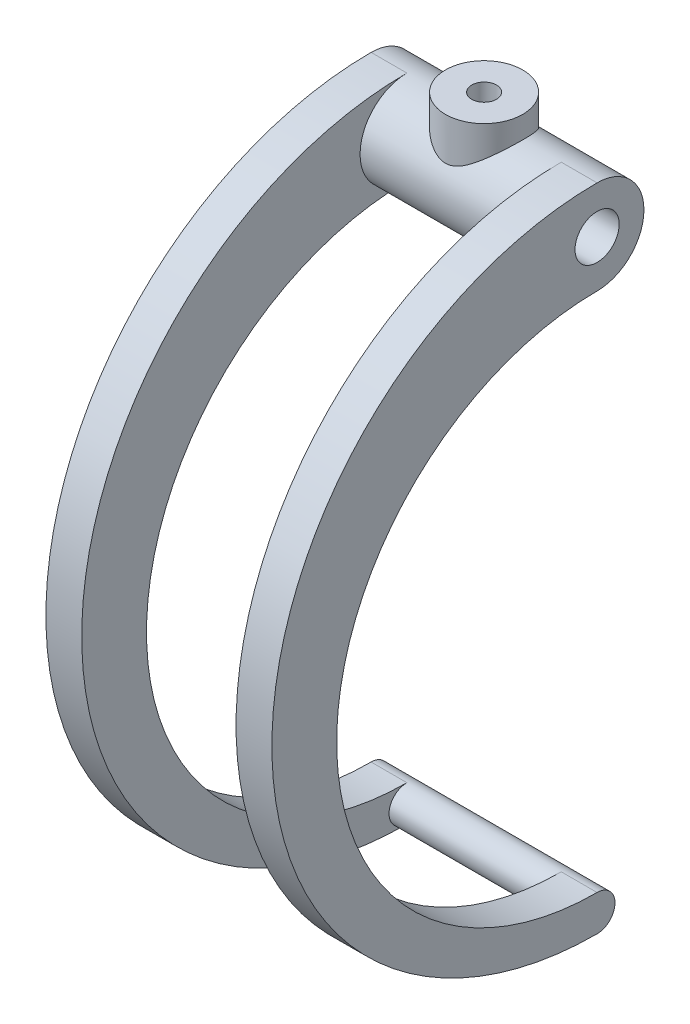
ISO-10303-21;
HEADER;
FILE_DESCRIPTION(('STEP AP214'),'2;1');
FILE_NAME('part.step','',(''),(''),'','','');
FILE_SCHEMA(('AUTOMOTIVE_DESIGN { 1 0 10303 214 1 1 1 1 }'));
ENDSEC;
DATA;
#1=APPLICATION_CONTEXT('core data for automotive mechanical design processes');
#2=APPLICATION_PROTOCOL_DEFINITION('international standard','automotive_design',2000,#1);
#3=PRODUCT_CONTEXT('',#1,'mechanical');
#4=PRODUCT('Part','Part','',(#3));
#5=PRODUCT_RELATED_PRODUCT_CATEGORY('part','',(#4));
#6=PRODUCT_DEFINITION_FORMATION('','',#4);
#7=PRODUCT_DEFINITION_CONTEXT('part definition',#1,'design');
#8=PRODUCT_DEFINITION('design','',#6,#7);
#9=PRODUCT_DEFINITION_SHAPE('','',#8);
#10=(LENGTH_UNIT() NAMED_UNIT(*) SI_UNIT(.MILLI.,.METRE.));
#11=(NAMED_UNIT(*) PLANE_ANGLE_UNIT() SI_UNIT($,.RADIAN.));
#12=(NAMED_UNIT(*) SI_UNIT($,.STERADIAN.) SOLID_ANGLE_UNIT());
#13=UNCERTAINTY_MEASURE_WITH_UNIT(LENGTH_MEASURE(1.E-05),#10,'distance_accuracy_value','');
#14=(GEOMETRIC_REPRESENTATION_CONTEXT(3) GLOBAL_UNCERTAINTY_ASSIGNED_CONTEXT((#13)) GLOBAL_UNIT_ASSIGNED_CONTEXT((#10,
#11,#12)) REPRESENTATION_CONTEXT('',''));
#15=CARTESIAN_POINT('',(0.,0.,0.));
#16=DIRECTION('',(0.,0.,1.));
#17=DIRECTION('',(1.,0.,0.));
#18=AXIS2_PLACEMENT_3D('',#15,#16,#17);
#19=CARTESIAN_POINT('',(32.54375,0.,0.));
#20=DIRECTION('',(-1.,0.,0.));
#21=DIRECTION('',(0.,0.,1.));
#22=AXIS2_PLACEMENT_3D('',#19,#20,#21);
#23=CYLINDRICAL_SURFACE('',#22,13.49375);
#24=CARTESIAN_POINT('',(0.,7.65464779153816,11.1125));
#25=CARTESIAN_POINT('',(0.200158173206272,7.65465325673617,11.1124978738501));
#26=CARTESIAN_POINT('',(0.400370789545028,7.66253889966513,11.1070771424515));
#27=CARTESIAN_POINT('',(0.79909256191196,7.69367298682588,11.0855322743124));
#28=CARTESIAN_POINT('',(0.9976005739117,7.71693103882504,11.069401443723));
#29=CARTESIAN_POINT('',(1.39179858537695,7.7777054292928,11.0267836778847));
#30=CARTESIAN_POINT('',(1.5874799957493,7.81525838928755,11.0002701385525));
#31=CARTESIAN_POINT('',(1.97442544136402,7.90293812276999,10.9374474884532));
#32=CARTESIAN_POINT('',(2.16568777700731,7.95306964893638,10.9011346747409));
#33=CARTESIAN_POINT('',(2.61394799986666,8.08484960801215,10.8039560072756));
#34=CARTESIAN_POINT('',(2.86865758574929,8.1712637695906,10.7389907411659));
#35=CARTESIAN_POINT('',(3.36760620110872,8.35948083501022,10.5931361818023));
#36=CARTESIAN_POINT('',(3.61183999413755,8.46129132242062,10.5122390352189));
#37=CARTESIAN_POINT('',(4.09038140849582,8.67634986535758,10.3354565417209));
#38=CARTESIAN_POINT('',(4.3246621045667,8.7896264494729,10.2395334678048));
#39=CARTESIAN_POINT('',(4.78289007420915,9.02390879623144,10.0336783723073));
#40=CARTESIAN_POINT('',(5.00683774973716,9.14491425778253,9.92374689628233));
#41=CARTESIAN_POINT('',(5.53642040437713,9.44349627972305,9.64155785401084));
#42=CARTESIAN_POINT('',(5.83703167688502,9.62356011113677,9.462466856834));
#43=CARTESIAN_POINT('',(6.41878371350189,9.98713957613382,9.07791108190461));
#44=CARTESIAN_POINT('',(6.69991648077871,10.1706565885516,8.87243556970538));
#45=CARTESIAN_POINT('',(7.24216246776736,10.535769866805,8.43562786117424));
#46=CARTESIAN_POINT('',(7.50329336309778,10.717367703346,8.20431894874998));
#47=CARTESIAN_POINT('',(8.00474927907056,11.0742342987079,7.71583301208199));
#48=CARTESIAN_POINT('',(8.24508187545876,11.2495053483755,7.45866548121699));
#49=CARTESIAN_POINT('',(8.65562885106799,11.5541678479156,6.97469940810094));
#50=CARTESIAN_POINT('',(8.8300386155095,11.6855270677951,6.75268825735483));
#51=CARTESIAN_POINT('',(9.163508845195,11.9395079897718,6.29272759611728));
#52=CARTESIAN_POINT('',(9.32257239456576,12.0621314461931,6.0547813044618));
#53=CARTESIAN_POINT('',(9.62372688643811,12.2963740019145,5.56366819136347));
#54=CARTESIAN_POINT('',(9.76583825905625,12.4080063183828,5.3105202552907));
#55=CARTESIAN_POINT('',(10.0316183528942,12.6182562781753,4.78954591847634));
#56=CARTESIAN_POINT('',(10.1552903339218,12.7168762215364,4.52172212368221));
#57=CARTESIAN_POINT('',(10.3631309906824,12.8835145874023,4.0192111389305));
#58=CARTESIAN_POINT('',(10.4504423942751,12.9538866441518,3.7866008775075));
#59=CARTESIAN_POINT('',(10.6100431506194,13.0829830340143,3.31315782429149));
#60=CARTESIAN_POINT('',(10.6823354892834,13.1417096822235,3.07232667798354));
#61=CARTESIAN_POINT('',(10.8108957394715,13.2464224967769,2.58378827749192));
#62=CARTESIAN_POINT('',(10.8671691266982,13.2924130165211,2.33608340478235));
#63=CARTESIAN_POINT('',(10.9628610066524,13.3707590917075,1.83529638815646));
#64=CARTESIAN_POINT('',(11.0022793032608,13.4031144884966,1.58221418170758));
#65=CARTESIAN_POINT('',(11.063723948938,13.4535984668296,1.071486346123));
#66=CARTESIAN_POINT('',(11.085679688776,13.471669287409,0.813826453860515));
#67=CARTESIAN_POINT('',(11.1115436191247,13.4929603935418,0.296985149964065));
#68=CARTESIAN_POINT('',(11.1154517726617,13.4961806486714,0.0378037352140966));
#69=CARTESIAN_POINT('',(11.1051498227096,13.4876972511228,-0.47994595331303));
#70=CARTESIAN_POINT('',(11.0909400384261,13.4759938613726,-0.738514237812036));
#71=CARTESIAN_POINT('',(11.0446583201216,13.4379290399988,-1.25294510378007));
#72=CARTESIAN_POINT('',(11.0125869365436,13.4115680600799,-1.50880776838089));
#73=CARTESIAN_POINT('',(10.9337348775411,13.3468991946308,-1.99973158186682));
#74=CARTESIAN_POINT('',(10.888020131279,13.3094583238863,-2.23508032083289));
#75=CARTESIAN_POINT('',(10.7820505170953,13.2229085730859,-2.70036931443103));
#76=CARTESIAN_POINT('',(10.7217906783647,13.173795704194,-2.93030769051575));
#77=CARTESIAN_POINT('',(10.587531997121,13.0647592128906,-3.38343859162769));
#78=CARTESIAN_POINT('',(10.5135359685794,13.0048378047681,-3.60663248744738));
#79=CARTESIAN_POINT('',(10.3526227117929,12.875098619512,-4.04542912622839));
#80=CARTESIAN_POINT('',(10.2657007353716,12.8052772061824,-4.26102904349342));
#81=CARTESIAN_POINT('',(10.071577873518,12.650162437239,-4.70257200349256));
#82=CARTESIAN_POINT('',(9.96326191871938,12.5640459232316,-4.92773502784488));
#83=CARTESIAN_POINT('',(9.73343390687931,12.3825842639337,-5.36744824273405));
#84=CARTESIAN_POINT('',(9.61191643842626,12.2872353359532,-5.58199402832746));
#85=CARTESIAN_POINT('',(9.35674067359687,12.0886643166985,-5.99991740187234));
#86=CARTESIAN_POINT('',(9.22308200612685,11.9854419847903,-6.20329464815425));
#87=CARTESIAN_POINT('',(8.944526456888,11.7724309948213,-6.59860473194218));
#88=CARTESIAN_POINT('',(8.79962800930607,11.6626414223679,-6.79053596829386));
#89=CARTESIAN_POINT('',(8.46822155735278,11.414462518478,-7.20140673006848));
#90=CARTESIAN_POINT('',(8.27931789407953,11.2748654433862,-7.41768794264334));
#91=CARTESIAN_POINT('',(7.88734925089227,10.9902565599566,-7.83319722612647));
#92=CARTESIAN_POINT('',(7.68428212186055,10.8452439314381,-8.03242269879259));
#93=CARTESIAN_POINT('',(7.26445377911727,10.5519342983307,-8.41403345880775));
#94=CARTESIAN_POINT('',(7.04767326323339,10.4036328641139,-8.59639407816748));
#95=CARTESIAN_POINT('',(6.60111761005685,10.1064627855853,-8.94387766137933));
#96=CARTESIAN_POINT('',(6.37134350586348,9.95759418724316,-9.1090019926984));
#97=CARTESIAN_POINT('',(5.90357747542457,9.66505097804654,-9.41873321405329));
#98=CARTESIAN_POINT('',(5.66584123504256,9.52133200968069,-9.56368393910445));
#99=CARTESIAN_POINT('',(5.1776751683299,9.23916849659579,-9.83654227165933));
#100=CARTESIAN_POINT('',(4.92724273203118,9.10072504669951,-9.96444635509883));
#101=CARTESIAN_POINT('',(4.41369265050445,8.83325401091959,-10.2022973472441));
#102=CARTESIAN_POINT('',(4.15059716440944,8.70421090375269,-10.3122742458703));
#103=CARTESIAN_POINT('',(3.61116213206307,8.46027099267314,-10.5133282074354));
#104=CARTESIAN_POINT('',(3.33483068407033,8.34536568851497,-10.6044166497182));
#105=CARTESIAN_POINT('',(2.69196218021027,8.10735228310394,-10.7879775082524));
#106=CARTESIAN_POINT('',(2.32118676867947,7.99038098903805,-10.8742054774738));
#107=CARTESIAN_POINT('',(1.75180643483988,7.85038870717374,-10.9752448616897));
#108=CARTESIAN_POINT('',(1.55994716277698,7.80965130991042,-11.0041973134561));
#109=CARTESIAN_POINT('',(1.17267427184446,7.74161073352183,-11.0521714981929));
#110=CARTESIAN_POINT('',(0.977262531155171,7.71430065798058,-11.0711983293753));
#111=CARTESIAN_POINT('',(0.582392775866277,7.67423575515303,-11.099009237688));
#112=CARTESIAN_POINT('',(0.382914094391627,7.66161651783872,-11.1076979141287));
#113=CARTESIAN_POINT('',(-0.0165957073466434,7.65206104496941,-11.1142830020697));
#114=CARTESIAN_POINT('',(-0.216626803851057,7.65512414510616,-11.112179870714));
#115=CARTESIAN_POINT('',(-0.615609659523671,7.67677556535434,-11.0972327174033));
#116=CARTESIAN_POINT('',(-0.814560293177145,7.69537777028688,-11.0843790894301));
#117=CARTESIAN_POINT('',(-1.20958989287208,7.74715166118764,-11.0482538545283));
#118=CARTESIAN_POINT('',(-1.40566840986256,7.78032560082138,-11.0249806360942));
#119=CARTESIAN_POINT('',(-1.83047008221055,7.86722466435775,-10.9631846068128));
#120=CARTESIAN_POINT('',(-2.05833919286696,7.9236527569376,-10.9226079034563));
#121=CARTESIAN_POINT('',(-2.5070541390232,8.05187062794462,-10.828433653938));
#122=CARTESIAN_POINT('',(-2.72789422977852,8.12367261885653,-10.7748257516423));
#123=CARTESIAN_POINT('',(-3.16238077265331,8.27967674860453,-10.6554165655429));
#124=CARTESIAN_POINT('',(-3.37600734160408,8.36391019039051,-10.5895843891494));
#125=CARTESIAN_POINT('',(-3.79529319120597,8.54177177154806,-10.4466480129291));
#126=CARTESIAN_POINT('',(-4.00095447426676,8.63539752823747,-10.3695466696554));
#127=CARTESIAN_POINT('',(-4.51607957289657,8.88329871977412,-10.159099548786));
#128=CARTESIAN_POINT('',(-4.82011007740373,9.04250158367981,-10.0182155181736));
#129=CARTESIAN_POINT('',(-5.41033975404071,9.37044590102684,-9.71218035415687));
#130=CARTESIAN_POINT('',(-5.69652964915475,9.5391922314593,-9.54701674295496));
#131=CARTESIAN_POINT('',(-6.25182120673512,9.88083916569843,-9.19298157368049));
#132=CARTESIAN_POINT('',(-6.5209017119047,10.0537445620731,-9.00408149016425));
#133=CARTESIAN_POINT('',(-7.04148775075236,10.3989554841705,-8.60308230968789));
#134=CARTESIAN_POINT('',(-7.29299654750348,10.5712611155927,-8.39098753885672));
#135=CARTESIAN_POINT('',(-7.78521944783512,10.9165750413869,-7.9368453561485));
#136=CARTESIAN_POINT('',(-8.02537299311983,11.0894454717581,-7.6940834162074));
#137=CARTESIAN_POINT('',(-8.48501723868554,11.4264937019629,-7.18400918285138));
#138=CARTESIAN_POINT('',(-8.70450444009582,11.5906700278085,-6.91669274737098));
#139=CARTESIAN_POINT('',(-9.12015201065641,11.9059873648984,-6.35855671191062));
#140=CARTESIAN_POINT('',(-9.31636984374381,12.057160223288,-6.06779812040438));
#141=CARTESIAN_POINT('',(-9.68336717647789,12.3429327699294,-5.46305693465903));
#142=CARTESIAN_POINT('',(-9.8541596451571,12.4775409014413,-5.14908630364206));
#143=CARTESIAN_POINT('',(-10.1189376065204,12.6878771865057,-4.59967349621582));
#144=CARTESIAN_POINT('',(-10.2203743619606,12.7689681745138,-4.36984212197211));
#145=CARTESIAN_POINT('',(-10.4084635166384,12.9200077387901,-3.90068825995742));
#146=CARTESIAN_POINT('',(-10.495119776878,12.9899592246321,-3.66136827102253));
#147=CARTESIAN_POINT('',(-10.652509075995,13.1174484855083,-3.17445054857292));
#148=CARTESIAN_POINT('',(-10.723250061933,13.1749924554549,-2.92685701758653));
#149=CARTESIAN_POINT('',(-10.8478266235233,13.2765836907755,-2.42471056862091));
#150=CARTESIAN_POINT('',(-10.9016617225908,13.3206305756595,-2.17015745466764));
#151=CARTESIAN_POINT('',(-10.9917846098779,13.3944873078892,-1.65445162558744));
#152=CARTESIAN_POINT('',(-11.0279752000547,13.42421828254,-1.39327051063631));
#153=CARTESIAN_POINT('',(-11.0817197828913,13.4684041907134,-0.867705553185114));
#154=CARTESIAN_POINT('',(-11.0992738193061,13.4828591601011,-0.603321718205874));
#155=CARTESIAN_POINT('',(-11.1154145881808,13.4961495743592,-0.0736154747191597));
#156=CARTESIAN_POINT('',(-11.1140037259827,13.4949870000223,0.191706810496137));
#157=CARTESIAN_POINT('',(-11.0922461081493,13.4770737841662,0.721032640230688));
#158=CARTESIAN_POINT('',(-11.0719003528382,13.460323966116,0.985036253674202));
#159=CARTESIAN_POINT('',(-11.015121729811,13.4136610950291,1.48772666558404));
#160=CARTESIAN_POINT('',(-10.9801648157291,13.3849564398419,1.72669550479454));
#161=CARTESIAN_POINT('',(-10.8951832588606,13.3153316603735,2.2001061983821));
#162=CARTESIAN_POINT('',(-10.8451596273287,13.2744123559222,2.43454835545962));
#163=CARTESIAN_POINT('',(-10.7307450248186,13.1811011111513,2.89752098478787));
#164=CARTESIAN_POINT('',(-10.666355700013,13.1287104853493,3.12605213103884));
#165=CARTESIAN_POINT('',(-10.5239918481106,13.0133123985187,3.57617106757022));
#166=CARTESIAN_POINT('',(-10.4460122219578,12.9503009528707,3.79775621477531));
#167=CARTESIAN_POINT('',(-10.2723179782714,12.8105943812779,4.2459750602693));
#168=CARTESIAN_POINT('',(-10.1758227445825,12.7333070909699,4.47212100815203));
#169=CARTESIAN_POINT('',(-9.96958076220157,12.5691001799001,4.9147497466732));
#170=CARTESIAN_POINT('',(-9.85982879301203,12.4821767655512,5.13122868418015));
#171=CARTESIAN_POINT('',(-9.62807330074146,12.2999308784791,5.55391506732843));
#172=CARTESIAN_POINT('',(-9.50606634021142,12.2046060501355,5.76011960666397));
#173=CARTESIAN_POINT('',(-9.25073726108164,12.006800612623,6.16183256860675));
#174=CARTESIAN_POINT('',(-9.11741292131545,11.9043185994768,6.35733887912265));
#175=CARTESIAN_POINT('',(-8.77588092800371,11.6444121845163,6.82570318137891));
#176=CARTESIAN_POINT('',(-8.56165462005177,11.4835773974757,7.09231162173289));
#177=CARTESIAN_POINT('',(-8.11274208657055,11.1528984050504,7.60173885922635));
#178=CARTESIAN_POINT('',(-7.87804719939062,10.9830503975783,7.84454749183124));
#179=CARTESIAN_POINT('',(-7.38919390059591,10.6378464806425,8.30667458872492));
#180=CARTESIAN_POINT('',(-7.13499679026323,10.4624800497471,8.52594416250153));
#181=CARTESIAN_POINT('',(-6.60840632864625,10.1106981344861,8.94029457720885));
#182=CARTESIAN_POINT('',(-6.33601791955411,9.93428294681534,9.13538194712935));
#183=CARTESIAN_POINT('',(-5.82385573177197,9.61655992973209,9.46815975541527));
#184=CARTESIAN_POINT('',(-5.58704829761881,9.47465366114422,9.60985853261255));
#185=CARTESIAN_POINT('',(-5.10094349148607,9.19638540326929,9.87648172212527));
#186=CARTESIAN_POINT('',(-4.85164448207422,9.06002414510478,10.0014039273784));
#187=CARTESIAN_POINT('',(-4.34073762767993,8.79703104221172,10.2334851619092));
#188=CARTESIAN_POINT('',(-4.07915805983171,8.67037845883086,10.340682654108));
#189=CARTESIAN_POINT('',(-3.54285584021351,8.4313649347292,10.5364706291581));
#190=CARTESIAN_POINT('',(-3.26814123130661,8.31899539859431,10.6250723239078));
#191=CARTESIAN_POINT('',(-2.80281418727001,8.14984804438257,10.7549252720363));
#192=CARTESIAN_POINT('',(-2.61591456644483,8.08727214768186,10.8019626643694));
#193=CARTESIAN_POINT('',(-2.23685849081192,7.97273836232899,10.8867721690228));
#194=CARTESIAN_POINT('',(-2.04470405177984,7.92077646511909,10.9245477802962));
#195=CARTESIAN_POINT('',(-1.65634170545101,7.82953370741223,10.990125059626));
#196=CARTESIAN_POINT('',(-1.46014794019061,7.79021467338008,11.0179567808426));
#197=CARTESIAN_POINT('',(-1.06431956764182,7.72582436431672,11.063204621439));
#198=CARTESIAN_POINT('',(-0.864687356987603,7.70074354867868,11.080627715741));
#199=CARTESIAN_POINT('',(-0.553828489152112,7.6738681323521,11.0992412441856));
#200=CARTESIAN_POINT('',(-0.443263408678344,7.6666734561582,11.1042083102263));
#201=CARTESIAN_POINT('',(-0.22180449878181,7.65706128998651,11.1108386102603));
#202=CARTESIAN_POINT('',(-0.11091060758825,7.65464476319102,11.1125011781312));
#203=CARTESIAN_POINT('',(0.,7.65464779153816,11.1125));
#204=B_SPLINE_CURVE_WITH_KNOTS('',3,(#24,#25,#26,#27,#28,#29,#30,#31,#32,#33,#34,#35,#36,#37,
#38,#39,#40,#41,#42,#43,#44,#45,#46,#47,#48,#49,#50,#51,#52,#53,#54,#55,#56,#57,#58,#59,#60,#61,
#62,#63,#64,#65,#66,#67,#68,#69,#70,#71,#72,#73,#74,#75,#76,#77,#78,#79,#80,#81,#82,#83,#84,#85,
#86,#87,#88,#89,#90,#91,#92,#93,#94,#95,#96,#97,#98,#99,#100,#101,#102,#103,#104,#105,#106,#107,
#108,#109,#110,#111,#112,#113,#114,#115,#116,#117,#118,#119,#120,#121,#122,#123,#124,#125,#126,
#127,#128,#129,#130,#131,#132,#133,#134,#135,#136,#137,#138,#139,#140,#141,#142,#143,#144,#145,
#146,#147,#148,#149,#150,#151,#152,#153,#154,#155,#156,#157,#158,#159,#160,#161,#162,#163,#164,
#165,#166,#167,#168,#169,#170,#171,#172,#173,#174,#175,#176,#177,#178,#179,#180,#181,#182,#183,
#184,#185,#186,#187,#188,#189,#190,#191,#192,#193,#194,#195,#196,#197,#198,#199,#200,#201,#202,
#203),.UNSPECIFIED.,.T.,.F.,(4,2,2,2,2,2,2,2,2,2,2,2,2,2,2,2,2,2,2,2,2,2,2,2,2,2,2,2,2,2,2,2,2,
2,2,2,2,2,2,2,2,2,2,2,2,2,2,2,2,2,2,2,2,2,2,2,2,2,2,2,2,2,2,2,2,2,2,2,2,2,2,2,2,2,2,2,2,2,2,2,2,
2,2,2,2,2,2,2,2,4),(0.,0.600346189548344,1.20106795118138,1.80333914845296,2.40583825113429,
3.23460641920697,4.06378414057431,4.89507814954139,5.72633979370423,6.90538335537796,
8.08490813569156,9.26337824954524,10.4414172848216,11.374762117021,12.3079189825918,
13.2399396312954,14.1717953168662,14.9457186220419,15.7194879174185,16.4929923994408,
17.2665058814096,18.0431313592117,18.8197584280621,19.596371814324,20.3729612689295,
21.1001310860241,21.8275497673274,22.554819595056,23.2823572387134,24.0744582347454,
24.8668851535598,25.6593363009229,26.4518980435596,27.4088966767204,28.3660408389489,
29.3245635640585,30.2830101854285,31.2223198325991,32.1618233636994,33.099738726293,
34.0370873898805,35.2270839645382,35.8212621818612,36.4151349032664,37.0144464112744,
37.6137325324874,38.2135547136961,38.8134696961268,39.527053810519,40.241206888105,
40.9571899266769,41.6729917887678,42.7843021147684,43.8961855766894,45.0094182646893,
46.1224436724269,47.2693035700313,48.4163572864555,49.560516599612,50.7040902825879,
51.4953133402119,52.2863293947553,53.0769495859368,53.8675920630713,54.6625420663562,
55.4574902032514,56.252337516828,57.0471428412656,57.7759564006531,58.5047210541029,
59.2334022408703,59.9623574183855,60.7348107673105,61.5075693059435,62.2805452070701,
63.0536731659633,64.1858962009875,65.318600703297,66.4536140764603,67.588320335066,
68.5185786029737,69.4489591325039,70.377293443332,71.3050664186472,71.9124925808327,
72.5196889122929,73.1250342894682,73.7299735624734,74.0625672380404,74.3952279512129),.UNSPECIFIED.);
#205=CARTESIAN_POINT('',(0.,7.65464779153816,11.1125));
#206=VERTEX_POINT('',#205);
#207=EDGE_CURVE('E165',#206,#206,#204,.T.);
#208=ORIENTED_EDGE('',*,*,#207,.F.);
#209=EDGE_LOOP('',(#208));
#210=FACE_BOUND('',#209,.T.);
#211=DIRECTION('',(1.,0.,0.));
#212=VECTOR('',#211,1.);
#213=CARTESIAN_POINT('',(22.225,-13.49375,0.));
#214=LINE('',#213,#212);
#215=CARTESIAN_POINT('',(22.225,-13.49375,0.));
#216=VERTEX_POINT('',#215);
#217=CARTESIAN_POINT('',(32.54375,-13.49375,0.));
#218=VERTEX_POINT('',#217);
#219=EDGE_CURVE('E150',#216,#218,#214,.T.);
#220=ORIENTED_EDGE('',*,*,#219,.F.);
#221=CARTESIAN_POINT('',(22.225,0.,0.));
#222=DIRECTION('',(1.,0.,0.));
#223=DIRECTION('',(0.,0.,-1.));
#224=AXIS2_PLACEMENT_3D('',#221,#222,#223);
#225=CIRCLE('',#224,13.49375);
#226=CARTESIAN_POINT('',(22.225,13.49375,0.));
#227=VERTEX_POINT('',#226);
#228=EDGE_CURVE('E149',#227,#216,#225,.T.);
#229=ORIENTED_EDGE('',*,*,#228,.F.);
#230=DIRECTION('',(1.,0.,0.));
#231=VECTOR('',#230,1.);
#232=CARTESIAN_POINT('',(22.225,13.49375,0.));
#233=LINE('',#232,#231);
#234=CARTESIAN_POINT('',(32.54375,13.49375,0.));
#235=VERTEX_POINT('',#234);
#236=EDGE_CURVE('E146',#227,#235,#233,.T.);
#237=ORIENTED_EDGE('',*,*,#236,.T.);
#238=CARTESIAN_POINT('',(32.54375,0.,0.));
#239=DIRECTION('',(1.,0.,0.));
#240=DIRECTION('',(0.,0.,-1.));
#241=AXIS2_PLACEMENT_3D('',#238,#239,#240);
#242=CIRCLE('',#241,13.49375);
#243=EDGE_CURVE('E11',#218,#235,#242,.T.);
#244=ORIENTED_EDGE('',*,*,#243,.F.);
#245=EDGE_LOOP('',(#220,#229,#237,#244));
#246=FACE_BOUND('',#245,.T.);
#247=CARTESIAN_POINT('',(-22.225,0.,0.));
#248=DIRECTION('',(-1.,0.,0.));
#249=DIRECTION('',(0.,0.,1.));
#250=AXIS2_PLACEMENT_3D('',#247,#248,#249);
#251=CIRCLE('',#250,13.49375);
#252=CARTESIAN_POINT('',(-22.225,-13.49375,0.));
#253=VERTEX_POINT('',#252);
#254=CARTESIAN_POINT('',(-22.225,13.49375,0.));
#255=VERTEX_POINT('',#254);
#256=EDGE_CURVE('E53',#253,#255,#251,.T.);
#257=ORIENTED_EDGE('',*,*,#256,.F.);
#258=DIRECTION('',(-1.,0.,0.));
#259=VECTOR('',#258,1.);
#260=CARTESIAN_POINT('',(-22.225,-13.49375,0.));
#261=LINE('',#260,#259);
#262=CARTESIAN_POINT('',(-32.54375,-13.49375,0.));
#263=VERTEX_POINT('',#262);
#264=EDGE_CURVE('E124',#253,#263,#261,.T.);
#265=ORIENTED_EDGE('',*,*,#264,.T.);
#266=CARTESIAN_POINT('',(-32.54375,0.,0.));
#267=DIRECTION('',(1.,0.,0.));
#268=DIRECTION('',(0.,0.,-1.));
#269=AXIS2_PLACEMENT_3D('',#266,#267,#268);
#270=CIRCLE('',#269,13.49375);
#271=CARTESIAN_POINT('',(-32.54375,13.49375,0.));
#272=VERTEX_POINT('',#271);
#273=EDGE_CURVE('E38',#263,#272,#270,.T.);
#274=ORIENTED_EDGE('',*,*,#273,.T.);
#275=DIRECTION('',(-1.,0.,0.));
#276=VECTOR('',#275,1.);
#277=CARTESIAN_POINT('',(-22.225,13.49375,0.));
#278=LINE('',#277,#276);
#279=EDGE_CURVE('E49',#255,#272,#278,.T.);
#280=ORIENTED_EDGE('',*,*,#279,.F.);
#281=EDGE_LOOP('',(#257,#265,#274,#280));
#282=FACE_BOUND('',#281,.T.);
#283=ADVANCED_FACE('F35',(#210,#246,#282),#23,.T.);
#284=CARTESIAN_POINT('',(32.54375,0.,0.));
#285=DIRECTION('',(1.,0.,0.));
#286=DIRECTION('',(0.,0.,-1.));
#287=AXIS2_PLACEMENT_3D('',#284,#285,#286);
#288=PLANE('',#287);
#289=CARTESIAN_POINT('',(32.54375,-80.16875,0.));
#290=DIRECTION('',(1.,0.,0.));
#291=DIRECTION('',(0.,0.,-1.));
#292=AXIS2_PLACEMENT_3D('',#289,#290,#291);
#293=CIRCLE('',#292,93.6625);
#294=CARTESIAN_POINT('',(32.54375,-173.83125,0.));
#295=VERTEX_POINT('',#294);
#296=EDGE_CURVE('E122',#235,#295,#293,.T.);
#297=ORIENTED_EDGE('',*,*,#296,.T.);
#298=CARTESIAN_POINT('',(32.54375,-168.671875,0.));
#299=DIRECTION('',(1.,0.,0.));
#300=DIRECTION('',(0.,0.,-1.));
#301=AXIS2_PLACEMENT_3D('',#298,#299,#300);
#302=CIRCLE('',#301,5.15937500000001);
#303=CARTESIAN_POINT('',(32.54375,-163.5125,0.));
#304=VERTEX_POINT('',#303);
#305=EDGE_CURVE('E141',#295,#304,#302,.T.);
#306=ORIENTED_EDGE('',*,*,#305,.T.);
#307=CARTESIAN_POINT('',(32.54375,-88.503125,0.));
#308=DIRECTION('',(1.,0.,0.));
#309=DIRECTION('',(0.,0.,-1.));
#310=AXIS2_PLACEMENT_3D('',#307,#308,#309);
#311=CIRCLE('',#310,75.009375);
#312=EDGE_CURVE('E135',#218,#304,#311,.T.);
#313=ORIENTED_EDGE('',*,*,#312,.F.);
#314=ORIENTED_EDGE('',*,*,#243,.T.);
#315=EDGE_LOOP('',(#297,#306,#313,#314));
#316=FACE_BOUND('',#315,.T.);
#317=CARTESIAN_POINT('',(32.54375,0.,0.));
#318=DIRECTION('',(1.,0.,0.));
#319=DIRECTION('',(0.,0.,-1.));
#320=AXIS2_PLACEMENT_3D('',#317,#318,#319);
#321=CIRCLE('',#320,6.3627);
#322=CARTESIAN_POINT('',(32.54375,0.,-6.3627));
#323=VERTEX_POINT('',#322);
#324=EDGE_CURVE('E230',#323,#323,#321,.T.);
#325=ORIENTED_EDGE('',*,*,#324,.F.);
#326=EDGE_LOOP('',(#325));
#327=FACE_BOUND('',#326,.T.);
#328=ADVANCED_FACE('F202',(#316,#327),#288,.T.);
#329=CARTESIAN_POINT('',(-32.54375,0.,0.));
#330=DIRECTION('',(1.,0.,0.));
#331=DIRECTION('',(0.,0.,-1.));
#332=AXIS2_PLACEMENT_3D('',#329,#330,#331);
#333=PLANE('',#332);
#334=CARTESIAN_POINT('',(-32.54375,-88.503125,0.));
#335=DIRECTION('',(1.,0.,0.));
#336=DIRECTION('',(0.,0.,-1.));
#337=AXIS2_PLACEMENT_3D('',#334,#335,#336);
#338=CIRCLE('',#337,75.009375);
#339=CARTESIAN_POINT('',(-32.54375,-163.5125,0.));
#340=VERTEX_POINT('',#339);
#341=EDGE_CURVE('E223',#263,#340,#338,.T.);
#342=ORIENTED_EDGE('',*,*,#341,.T.);
#343=CARTESIAN_POINT('',(-32.54375,-168.671875,0.));
#344=DIRECTION('',(1.,0.,0.));
#345=DIRECTION('',(0.,0.,-1.));
#346=AXIS2_PLACEMENT_3D('',#343,#344,#345);
#347=CIRCLE('',#346,5.15937500000001);
#348=CARTESIAN_POINT('',(-32.54375,-173.83125,0.));
#349=VERTEX_POINT('',#348);
#350=EDGE_CURVE('E116',#349,#340,#347,.T.);
#351=ORIENTED_EDGE('',*,*,#350,.F.);
#352=CARTESIAN_POINT('',(-32.54375,-80.16875,0.));
#353=DIRECTION('',(1.,0.,0.));
#354=DIRECTION('',(0.,0.,-1.));
#355=AXIS2_PLACEMENT_3D('',#352,#353,#354);
#356=CIRCLE('',#355,93.6625);
#357=EDGE_CURVE('E120',#272,#349,#356,.T.);
#358=ORIENTED_EDGE('',*,*,#357,.F.);
#359=ORIENTED_EDGE('',*,*,#273,.F.);
#360=EDGE_LOOP('',(#342,#351,#358,#359));
#361=FACE_BOUND('',#360,.T.);
#362=CARTESIAN_POINT('',(-32.54375,0.,0.));
#363=DIRECTION('',(1.,0.,0.));
#364=DIRECTION('',(0.,0.,-1.));
#365=AXIS2_PLACEMENT_3D('',#362,#363,#364);
#366=CIRCLE('',#365,6.3627);
#367=CARTESIAN_POINT('',(-32.54375,0.,-6.3627));
#368=VERTEX_POINT('',#367);
#369=EDGE_CURVE('E232',#368,#368,#366,.T.);
#370=ORIENTED_EDGE('',*,*,#369,.T.);
#371=EDGE_LOOP('',(#370));
#372=FACE_BOUND('',#371,.T.);
#373=ADVANCED_FACE('F207',(#361,#372),#333,.F.);
#374=CARTESIAN_POINT('',(32.54375,0.,0.));
#375=DIRECTION('',(-1.,0.,0.));
#376=DIRECTION('',(0.,0.,1.));
#377=AXIS2_PLACEMENT_3D('',#374,#375,#376);
#378=CYLINDRICAL_SURFACE('',#377,6.3627);
#379=ORIENTED_EDGE('',*,*,#369,.F.);
#380=EDGE_LOOP('',(#379));
#381=FACE_BOUND('',#380,.T.);
#382=CARTESIAN_POINT('',(0.,5.26551614510629,3.571875));
#383=CARTESIAN_POINT('',(0.0911962557052863,5.2655139946255,3.57187656351968));
#384=CARTESIAN_POINT('',(0.182376824485864,5.26789285496165,3.56837844298337));
#385=CARTESIAN_POINT('',(0.363994569367833,5.27730334078769,3.55444700494473));
#386=CARTESIAN_POINT('',(0.454431520601322,5.28433632481541,3.54401166246455));
#387=CARTESIAN_POINT('',(0.633907374944398,5.30278427697296,3.51634828018515));
#388=CARTESIAN_POINT('',(0.72294459861935,5.31420414458461,3.49911264490807));
#389=CARTESIAN_POINT('',(0.898907756702683,5.34098455150934,3.45809649462649));
#390=CARTESIAN_POINT('',(0.985832720236867,5.35634686676919,3.43431302968145));
#391=CARTESIAN_POINT('',(1.24141914593772,5.40732028203631,3.35393279398638));
#392=CARTESIAN_POINT('',(1.4062655446647,5.44797279230561,3.28808846346895));
#393=CARTESIAN_POINT('',(1.72240300561075,5.53798223843543,3.13410720533647));
#394=CARTESIAN_POINT('',(1.87369086546996,5.58734122252968,3.04596502993866));
#395=CARTESIAN_POINT('',(2.17612668715027,5.69554244709497,2.83897102648463));
#396=CARTESIAN_POINT('',(2.3255711675969,5.75483565133355,2.71785854553555));
#397=CARTESIAN_POINT('',(2.60338641703106,5.87260017859098,2.4530737953694));
#398=CARTESIAN_POINT('',(2.73174397455531,5.93107096553051,2.3093874925485));
#399=CARTESIAN_POINT('',(2.97527497737888,6.04693460486721,1.98751615576312));
#400=CARTESIAN_POINT('',(3.08820213844105,6.10375042407819,1.80738538440089));
#401=CARTESIAN_POINT('',(3.23300654526813,6.17869859506121,1.52229116450439));
#402=CARTESIAN_POINT('',(3.27718769053379,6.20197483121483,1.42474138755335));
#403=CARTESIAN_POINT('',(3.35684345207869,6.24443068641929,1.22531425161814));
#404=CARTESIAN_POINT('',(3.39232346296905,6.26361284279439,1.12343962019851));
#405=CARTESIAN_POINT('',(3.45142838832486,6.29582882847985,0.925049798983941));
#406=CARTESIAN_POINT('',(3.47580745735926,6.30924806957694,0.828820921732971));
#407=CARTESIAN_POINT('',(3.51652161086931,6.33176877627808,0.634223257715059));
#408=CARTESIAN_POINT('',(3.53286094924417,6.34087252515722,0.535855631413807));
#409=CARTESIAN_POINT('',(3.55726207023337,6.35450007816088,0.337826024361916));
#410=CARTESIAN_POINT('',(3.56532740825714,6.35902584947021,0.23816461821861));
#411=CARTESIAN_POINT('',(3.5730663660679,6.36336805949443,0.03841879656053));
#412=CARTESIAN_POINT('',(3.57274068977687,6.36318489324198,-0.0616655827667487));
#413=CARTESIAN_POINT('',(3.56419772403005,6.35839247671568,-0.250414073158711));
#414=CARTESIAN_POINT('',(3.55684689323916,6.35426919384013,-0.339130743256615));
#415=CARTESIAN_POINT('',(3.53559290086408,6.34239742909985,-0.515539858934463));
#416=CARTESIAN_POINT('',(3.52168757626847,6.33464775051492,-0.603231956603933));
#417=CARTESIAN_POINT('',(3.4703632671493,6.30620549780235,-0.863783372445094));
#418=CARTESIAN_POINT('',(3.42332751619212,6.2803146886561,-1.03429562422153));
#419=CARTESIAN_POINT('',(3.3050614691191,6.21663932391384,-1.36611061172564));
#420=CARTESIAN_POINT('',(3.23359839469854,6.17874060364965,-1.52730661621289));
#421=CARTESIAN_POINT('',(3.06903003552706,6.09422832108286,-1.83573351777466));
#422=CARTESIAN_POINT('',(2.97591808850803,6.04761207689764,-1.98296009619025));
#423=CARTESIAN_POINT('',(2.75897623380048,5.94369950506963,-2.27667815732912));
#424=CARTESIAN_POINT('',(2.63288716056249,5.88579216023515,-2.42128497955805));
#425=CARTESIAN_POINT('',(2.35951316544331,5.7686791731678,-2.68842178520026));
#426=CARTESIAN_POINT('',(2.21220520822722,5.70947218001606,-2.81092744563875));
#427=CARTESIAN_POINT('',(1.88378803827189,5.59006898921974,-3.04196149547254));
#428=CARTESIAN_POINT('',(1.7008040562758,5.53030141270485,-3.14809920742943));
#429=CARTESIAN_POINT('',(1.41227559589066,5.45083649179356,-3.28253816649106));
#430=CARTESIAN_POINT('',(1.31373830498386,5.42604236991733,-3.32322832600347));
#431=CARTESIAN_POINT('',(1.11254204853609,5.38087566576575,-3.39587338012178));
#432=CARTESIAN_POINT('',(1.00988598392469,5.3605000340664,-3.42783430319453));
#433=CARTESIAN_POINT('',(0.809521296524595,5.32653966559549,-3.48034880338651));
#434=CARTESIAN_POINT('',(0.712066558810442,5.31254433397337,-3.50160636900458));
#435=CARTESIAN_POINT('',(0.515174714103175,5.28975552233703,-3.5359388654831));
#436=CARTESIAN_POINT('',(0.415738828657256,5.28095893355675,-3.54901868677696));
#437=CARTESIAN_POINT('',(0.215855013684651,5.26899613052608,-3.56675627437298));
#438=CARTESIAN_POINT('',(0.115407994470436,5.26582524046927,-3.57142103491745));
#439=CARTESIAN_POINT('',(-0.0855031963789553,5.2652495107262,-3.57226637157538));
#440=CARTESIAN_POINT('',(-0.185967364449352,5.26784397079775,-3.56844797802738));
#441=CARTESIAN_POINT('',(-0.454904174222394,5.28245214179453,-3.54682875130459));
#442=CARTESIAN_POINT('',(-0.622541713874496,5.29972411254033,-3.52120662815355));
#443=CARTESIAN_POINT('',(-0.95051465373826,5.34814643966452,-3.44719762345752));
#444=CARTESIAN_POINT('',(-1.11084652921801,5.37930341854708,-3.39879987838105));
#445=CARTESIAN_POINT('',(-1.42738699925101,5.45329700908026,-3.27881789912011));
#446=CARTESIAN_POINT('',(-1.58317090580604,5.49655269902752,-3.20637997428544));
#447=CARTESIAN_POINT('',(-1.88130067945101,5.5897092689375,-3.04106756293662));
#448=CARTESIAN_POINT('',(-2.02364004815466,5.63961333457138,-2.94818326522364));
#449=CARTESIAN_POINT('',(-2.31567426673115,5.75037584417902,-2.72670100891597));
#450=CARTESIAN_POINT('',(-2.46265190300592,5.81167531399209,-2.5947321743654));
#451=CARTESIAN_POINT('',(-2.73357176664752,5.93155173452773,-2.30755541208184));
#452=CARTESIAN_POINT('',(-2.8574989805384,5.99012689232436,-2.15233245618518));
#453=CARTESIAN_POINT('',(-3.0267462682728,6.0732424672126,-1.89952657086194));
#454=CARTESIAN_POINT('',(-3.08161062175151,6.10082578184774,-1.809201060966));
#455=CARTESIAN_POINT('',(-3.18342697123233,6.15288129577463,-1.62335892142832));
#456=CARTESIAN_POINT('',(-3.23038250343027,6.17735488427992,-1.52784463719379));
#457=CARTESIAN_POINT('',(-3.3158192604345,6.22245957567317,-1.33229636260819));
#458=CARTESIAN_POINT('',(-3.35430564644424,6.24309301760509,-1.23226516996795));
#459=CARTESIAN_POINT('',(-3.42231149741045,6.27989308844982,-1.02840379075609));
#460=CARTESIAN_POINT('',(-3.451832355494,6.29606041130444,-0.924574197219116));
#461=CARTESIAN_POINT('',(-3.49887566261129,6.32198135875744,-0.724955169594029));
#462=CARTESIAN_POINT('',(-3.51732422116627,6.33222587787019,-0.629446991854655));
#463=CARTESIAN_POINT('',(-3.54639188764955,6.34841788984128,-0.436891977151523));
#464=CARTESIAN_POINT('',(-3.55701188572567,6.35436587123664,-0.339845316403467));
#465=CARTESIAN_POINT('',(-3.57026079878677,6.36179145009245,-0.145075451102129));
#466=CARTESIAN_POINT('',(-3.57289338970678,6.36327110394865,-0.0473525785132348));
#467=CARTESIAN_POINT('',(-3.57014876675868,6.36173154224952,0.147915054814128));
#468=CARTESIAN_POINT('',(-3.56477200530713,6.35871258080313,0.245459825301269));
#469=CARTESIAN_POINT('',(-3.53849145242372,6.34400017734099,0.518048448492425));
#470=CARTESIAN_POINT('',(-3.50855419985625,6.32726988370198,0.692052509918214));
#471=CARTESIAN_POINT('',(-3.42403490315492,6.28080026102192,1.03200445262641));
#472=CARTESIAN_POINT('',(-3.36945003250679,6.25105943998514,1.19795140752627));
#473=CARTESIAN_POINT('',(-3.23570883935131,6.17998081093519,1.52327430327562));
#474=CARTESIAN_POINT('',(-3.15583527542475,6.13830840335574,1.68228068582721));
#475=CARTESIAN_POINT('',(-2.97469899082858,6.04717851741558,1.98510444667942));
#476=CARTESIAN_POINT('',(-2.87342808544791,5.99771806189321,2.1289159811222));
#477=CARTESIAN_POINT('',(-2.63871457866062,5.88867008364284,2.41529667230506));
#478=CARTESIAN_POINT('',(-2.50288718739215,5.82857599947732,2.55572262562505));
#479=CARTESIAN_POINT('',(-2.20997104650458,5.70891392233282,2.81290211069746));
#480=CARTESIAN_POINT('',(-2.05285524175484,5.64934670326179,2.92962503912909));
#481=CARTESIAN_POINT('',(-1.70705276466109,5.53275650136446,3.14462015343918));
#482=CARTESIAN_POINT('',(-1.51687997755182,5.47626239895443,3.24084258346129));
#483=CARTESIAN_POINT('',(-1.21881909116106,5.40387648494052,3.35919729504284));
#484=CARTESIAN_POINT('',(-1.11741604228513,5.38181947305101,3.39430173620485));
#485=CARTESIAN_POINT('',(-0.910981866552179,5.34278024704006,3.45542570447052));
#486=CARTESIAN_POINT('',(-0.805953027048188,5.32579489641393,3.48145084823472));
#487=CARTESIAN_POINT('',(-0.585110893540382,5.29671126185262,3.52555799877401));
#488=CARTESIAN_POINT('',(-0.469083890928183,5.2850814374843,3.54288770244976));
#489=CARTESIAN_POINT('',(-0.23536245080476,5.26948561865711,3.56604466578319));
#490=CARTESIAN_POINT('',(-0.117668167549186,5.26551891981598,3.57187298263104));
#491=CARTESIAN_POINT('',(0.,5.26551614510629,3.571875));
#492=B_SPLINE_CURVE_WITH_KNOTS('',3,(#382,#383,#384,#385,#386,#387,#388,#389,#390,#391,#392,
#393,#394,#395,#396,#397,#398,#399,#400,#401,#402,#403,#404,#405,#406,#407,#408,#409,#410,#411,
#412,#413,#414,#415,#416,#417,#418,#419,#420,#421,#422,#423,#424,#425,#426,#427,#428,#429,#430,
#431,#432,#433,#434,#435,#436,#437,#438,#439,#440,#441,#442,#443,#444,#445,#446,#447,#448,#449,
#450,#451,#452,#453,#454,#455,#456,#457,#458,#459,#460,#461,#462,#463,#464,#465,#466,#467,#468,
#469,#470,#471,#472,#473,#474,#475,#476,#477,#478,#479,#480,#481,#482,#483,#484,#485,#486,#487,
#488,#489,#490,#491),.UNSPECIFIED.,.T.,.F.,(4,2,2,2,2,2,2,2,2,2,2,2,2,2,2,2,2,2,2,2,2,2,2,2,2,2,
2,2,2,2,2,2,2,2,2,2,2,2,2,2,2,2,2,2,2,2,2,2,2,2,2,2,2,2,4),(0.,0.273464374191098,
0.547008607812912,0.820859241160977,1.09483345267741,1.63863779745907,2.18257024548674,
2.78396979668143,3.38574471390108,4.04201068740101,4.3703648834723,4.69851498582125,
4.9986132672281,5.29855259252943,5.59836297725608,5.89814821097873,6.16516636682975,
6.43227270158916,6.96595791247832,7.50487757436437,8.0439633045158,8.64271124702491,
9.24211416209566,9.89776945901523,10.2257155240973,10.5534345315284,10.8551461866743,
11.1566772399873,11.4579575577787,11.759201284964,12.2680040361816,12.7770497228435,
13.3065539408255,13.8363127976109,14.4542226885198,15.0725336452064,15.3998222919353,
15.7269642104928,16.0539062091485,16.380797379223,16.673827040398,16.9668233774436,
17.2596848523281,17.5525297852566,18.0819041510597,18.6113392393372,19.1573864789726,
19.7036429668547,20.3142671548874,20.9256747851946,21.5830974021253,21.9112963516553,
22.2392919082967,22.5921683473562,22.9450123490337),.UNSPECIFIED.);
#493=CARTESIAN_POINT('',(0.,5.26551614510629,3.571875));
#494=VERTEX_POINT('',#493);
#495=EDGE_CURVE('E157',#494,#494,#492,.T.);
#496=ORIENTED_EDGE('',*,*,#495,.T.);
#497=EDGE_LOOP('',(#496));
#498=FACE_BOUND('',#497,.T.);
#499=ORIENTED_EDGE('',*,*,#324,.T.);
#500=EDGE_LOOP('',(#499));
#501=FACE_BOUND('',#500,.T.);
#502=ADVANCED_FACE('F254',(#381,#498,#501),#378,.F.);
#503=CARTESIAN_POINT('',(0.,-13.49475,0.));
#504=DIRECTION('',(0.,1.,0.));
#505=DIRECTION('',(0.,0.,1.));
#506=AXIS2_PLACEMENT_3D('',#503,#504,#505);
#507=CYLINDRICAL_SURFACE('',#506,11.1125);
#508=CARTESIAN_POINT('',(0.,19.84375,0.));
#509=DIRECTION('',(0.,1.,0.));
#510=DIRECTION('',(0.,0.,1.));
#511=AXIS2_PLACEMENT_3D('',#508,#509,#510);
#512=CIRCLE('',#511,11.1125);
#513=CARTESIAN_POINT('',(0.,19.84375,11.1125));
#514=VERTEX_POINT('',#513);
#515=EDGE_CURVE('E239',#514,#514,#512,.T.);
#516=ORIENTED_EDGE('',*,*,#515,.F.);
#517=EDGE_LOOP('',(#516));
#518=FACE_BOUND('',#517,.T.);
#519=ORIENTED_EDGE('',*,*,#207,.T.);
#520=EDGE_LOOP('',(#519));
#521=FACE_BOUND('',#520,.T.);
#522=ADVANCED_FACE('F249',(#518,#521),#507,.T.);
#523=CARTESIAN_POINT('',(0.,19.84375,0.));
#524=DIRECTION('',(0.,1.,0.));
#525=DIRECTION('',(0.,0.,1.));
#526=AXIS2_PLACEMENT_3D('',#523,#524,#525);
#527=PLANE('',#526);
#528=CARTESIAN_POINT('',(0.,19.84375,0.));
#529=DIRECTION('',(0.,1.,0.));
#530=DIRECTION('',(0.,0.,1.));
#531=AXIS2_PLACEMENT_3D('',#528,#529,#530);
#532=CIRCLE('',#531,3.571875);
#533=CARTESIAN_POINT('',(0.,19.84375,3.571875));
#534=VERTEX_POINT('',#533);
#535=EDGE_CURVE('E164',#534,#534,#532,.T.);
#536=ORIENTED_EDGE('',*,*,#535,.F.);
#537=EDGE_LOOP('',(#536));
#538=FACE_BOUND('',#537,.T.);
#539=ORIENTED_EDGE('',*,*,#515,.T.);
#540=EDGE_LOOP('',(#539));
#541=FACE_BOUND('',#540,.T.);
#542=ADVANCED_FACE('F246',(#538,#541),#527,.T.);
#543=CARTESIAN_POINT('',(0.,-13.49475,0.));
#544=DIRECTION('',(0.,1.,0.));
#545=DIRECTION('',(0.,0.,1.));
#546=AXIS2_PLACEMENT_3D('',#543,#544,#545);
#547=CYLINDRICAL_SURFACE('',#546,3.571875);
#548=ORIENTED_EDGE('',*,*,#535,.T.);
#549=EDGE_LOOP('',(#548));
#550=FACE_BOUND('',#549,.T.);
#551=ORIENTED_EDGE('',*,*,#495,.F.);
#552=EDGE_LOOP('',(#551));
#553=FACE_BOUND('',#552,.T.);
#554=ADVANCED_FACE('F171',(#550,#553),#547,.F.);
#555=CARTESIAN_POINT('',(22.225,0.,0.));
#556=DIRECTION('',(1.,0.,0.));
#557=DIRECTION('',(0.,0.,-1.));
#558=AXIS2_PLACEMENT_3D('',#555,#556,#557);
#559=PLANE('',#558);
#560=CARTESIAN_POINT('',(22.225,-88.503125,0.));
#561=DIRECTION('',(1.,0.,0.));
#562=DIRECTION('',(0.,0.,-1.));
#563=AXIS2_PLACEMENT_3D('',#560,#561,#562);
#564=CIRCLE('',#563,75.009375);
#565=CARTESIAN_POINT('',(22.225,-163.5125,0.));
#566=VERTEX_POINT('',#565);
#567=EDGE_CURVE('E134',#216,#566,#564,.T.);
#568=ORIENTED_EDGE('',*,*,#567,.T.);
#569=CARTESIAN_POINT('',(22.225,-168.671875,0.));
#570=DIRECTION('',(1.,0.,0.));
#571=DIRECTION('',(0.,0.,-1.));
#572=AXIS2_PLACEMENT_3D('',#569,#570,#571);
#573=CIRCLE('',#572,5.15937500000001);
#574=CARTESIAN_POINT('',(22.225,-173.83125,0.));
#575=VERTEX_POINT('',#574);
#576=EDGE_CURVE('E109',#566,#575,#573,.T.);
#577=ORIENTED_EDGE('',*,*,#576,.T.);
#578=CARTESIAN_POINT('',(22.225,-80.16875,0.));
#579=DIRECTION('',(1.,0.,0.));
#580=DIRECTION('',(0.,0.,-1.));
#581=AXIS2_PLACEMENT_3D('',#578,#579,#580);
#582=CIRCLE('',#581,93.6625);
#583=EDGE_CURVE('E131',#227,#575,#582,.T.);
#584=ORIENTED_EDGE('',*,*,#583,.F.);
#585=ORIENTED_EDGE('',*,*,#228,.T.);
#586=EDGE_LOOP('',(#568,#577,#584,#585));
#587=FACE_BOUND('',#586,.T.);
#588=ADVANCED_FACE('F181',(#587),#559,.F.);
#589=CARTESIAN_POINT('',(22.225,-80.16875,0.));
#590=DIRECTION('',(1.,0.,0.));
#591=DIRECTION('',(0.,0.,-1.));
#592=AXIS2_PLACEMENT_3D('',#589,#590,#591);
#593=CYLINDRICAL_SURFACE('',#592,93.6625);
#594=ORIENTED_EDGE('',*,*,#296,.F.);
#595=ORIENTED_EDGE('',*,*,#236,.F.);
#596=ORIENTED_EDGE('',*,*,#583,.T.);
#597=DIRECTION('',(1.,0.,0.));
#598=VECTOR('',#597,1.);
#599=CARTESIAN_POINT('',(22.225,-173.83125,0.));
#600=LINE('',#599,#598);
#601=EDGE_CURVE('E138',#575,#295,#600,.T.);
#602=ORIENTED_EDGE('',*,*,#601,.T.);
#603=EDGE_LOOP('',(#594,#595,#596,#602));
#604=FACE_BOUND('',#603,.T.);
#605=ADVANCED_FACE('F176',(#604),#593,.T.);
#606=CARTESIAN_POINT('',(22.225,-88.503125,0.));
#607=DIRECTION('',(1.,0.,0.));
#608=DIRECTION('',(0.,0.,-1.));
#609=AXIS2_PLACEMENT_3D('',#606,#607,#608);
#610=CYLINDRICAL_SURFACE('',#609,75.009375);
#611=ORIENTED_EDGE('',*,*,#312,.T.);
#612=DIRECTION('',(1.,0.,0.));
#613=VECTOR('',#612,1.);
#614=CARTESIAN_POINT('',(22.225,-163.5125,0.));
#615=LINE('',#614,#613);
#616=EDGE_CURVE('E153',#566,#304,#615,.T.);
#617=ORIENTED_EDGE('',*,*,#616,.F.);
#618=ORIENTED_EDGE('',*,*,#567,.F.);
#619=ORIENTED_EDGE('',*,*,#219,.T.);
#620=EDGE_LOOP('',(#611,#617,#618,#619));
#621=FACE_BOUND('',#620,.T.);
#622=ADVANCED_FACE('F180',(#621),#610,.F.);
#623=CARTESIAN_POINT('',(22.225,-168.671875,0.));
#624=DIRECTION('',(1.,0.,0.));
#625=DIRECTION('',(0.,0.,-1.));
#626=AXIS2_PLACEMENT_3D('',#623,#624,#625);
#627=CYLINDRICAL_SURFACE('',#626,5.15937500000001);
#628=ORIENTED_EDGE('',*,*,#305,.F.);
#629=ORIENTED_EDGE('',*,*,#601,.F.);
#630=ORIENTED_EDGE('',*,*,#576,.F.);
#631=ORIENTED_EDGE('',*,*,#616,.T.);
#632=EDGE_LOOP('',(#628,#629,#630,#631));
#633=FACE_BOUND('',#632,.T.);
#634=ORIENTED_EDGE('',*,*,#350,.T.);
#635=DIRECTION('',(-1.,0.,0.));
#636=VECTOR('',#635,1.);
#637=CARTESIAN_POINT('',(-22.225,-163.5125,0.));
#638=LINE('',#637,#636);
#639=CARTESIAN_POINT('',(-22.225,-163.5125,0.));
#640=VERTEX_POINT('',#639);
#641=EDGE_CURVE('E105',#640,#340,#638,.T.);
#642=ORIENTED_EDGE('',*,*,#641,.F.);
#643=CARTESIAN_POINT('',(-22.225,-168.671875,0.));
#644=DIRECTION('',(-1.,0.,0.));
#645=DIRECTION('',(0.,0.,1.));
#646=AXIS2_PLACEMENT_3D('',#643,#644,#645);
#647=CIRCLE('',#646,5.15937500000001);
#648=CARTESIAN_POINT('',(-22.225,-173.83125,0.));
#649=VERTEX_POINT('',#648);
#650=EDGE_CURVE('E98',#649,#640,#647,.T.);
#651=ORIENTED_EDGE('',*,*,#650,.F.);
#652=DIRECTION('',(-1.,0.,0.));
#653=VECTOR('',#652,1.);
#654=CARTESIAN_POINT('',(-22.225,-173.83125,0.));
#655=LINE('',#654,#653);
#656=EDGE_CURVE('E103',#649,#349,#655,.T.);
#657=ORIENTED_EDGE('',*,*,#656,.T.);
#658=EDGE_LOOP('',(#634,#642,#651,#657));
#659=FACE_BOUND('',#658,.T.);
#660=ADVANCED_FACE('F101',(#633,#659),#627,.T.);
#661=CARTESIAN_POINT('',(-22.225,0.,0.));
#662=DIRECTION('',(-1.,0.,0.));
#663=DIRECTION('',(0.,0.,-1.));
#664=AXIS2_PLACEMENT_3D('',#661,#662,#663);
#665=PLANE('',#664);
#666=CARTESIAN_POINT('',(-22.225,-80.16875,0.));
#667=DIRECTION('',(1.,0.,0.));
#668=DIRECTION('',(0.,0.,-1.));
#669=AXIS2_PLACEMENT_3D('',#666,#667,#668);
#670=CIRCLE('',#669,93.6625);
#671=EDGE_CURVE('E112',#255,#649,#670,.T.);
#672=ORIENTED_EDGE('',*,*,#671,.T.);
#673=ORIENTED_EDGE('',*,*,#650,.T.);
#674=CARTESIAN_POINT('',(-22.225,-88.503125,0.));
#675=DIRECTION('',(1.,0.,0.));
#676=DIRECTION('',(0.,0.,-1.));
#677=AXIS2_PLACEMENT_3D('',#674,#675,#676);
#678=CIRCLE('',#677,75.009375);
#679=EDGE_CURVE('E115',#253,#640,#678,.T.);
#680=ORIENTED_EDGE('',*,*,#679,.F.);
#681=ORIENTED_EDGE('',*,*,#256,.T.);
#682=EDGE_LOOP('',(#672,#673,#680,#681));
#683=FACE_BOUND('',#682,.T.);
#684=ADVANCED_FACE('F113',(#683),#665,.F.);
#685=CARTESIAN_POINT('',(-22.225,-80.16875,0.));
#686=DIRECTION('',(-1.,0.,0.));
#687=DIRECTION('',(0.,0.,1.));
#688=AXIS2_PLACEMENT_3D('',#685,#686,#687);
#689=CYLINDRICAL_SURFACE('',#688,93.6625);
#690=ORIENTED_EDGE('',*,*,#357,.T.);
#691=ORIENTED_EDGE('',*,*,#656,.F.);
#692=ORIENTED_EDGE('',*,*,#671,.F.);
#693=ORIENTED_EDGE('',*,*,#279,.T.);
#694=EDGE_LOOP('',(#690,#691,#692,#693));
#695=FACE_BOUND('',#694,.T.);
#696=ADVANCED_FACE('F118',(#695),#689,.T.);
#697=CARTESIAN_POINT('',(-22.225,-88.503125,0.));
#698=DIRECTION('',(-1.,0.,0.));
#699=DIRECTION('',(0.,0.,1.));
#700=AXIS2_PLACEMENT_3D('',#697,#698,#699);
#701=CYLINDRICAL_SURFACE('',#700,75.009375);
#702=ORIENTED_EDGE('',*,*,#341,.F.);
#703=ORIENTED_EDGE('',*,*,#264,.F.);
#704=ORIENTED_EDGE('',*,*,#679,.T.);
#705=ORIENTED_EDGE('',*,*,#641,.T.);
#706=EDGE_LOOP('',(#702,#703,#704,#705));
#707=FACE_BOUND('',#706,.T.);
#708=ADVANCED_FACE('F194',(#707),#701,.F.);
#709=CLOSED_SHELL('',(#283,#328,#373,#502,#522,#542,#554,#588,#605,#622,#660,#684,#696,#708));
#710=MANIFOLD_SOLID_BREP('B2',#709);
#711=ADVANCED_BREP_SHAPE_REPRESENTATION('',(#18,#710),#14);
#712=SHAPE_DEFINITION_REPRESENTATION(#9,#711);
ENDSEC;
END-ISO-10303-21;
